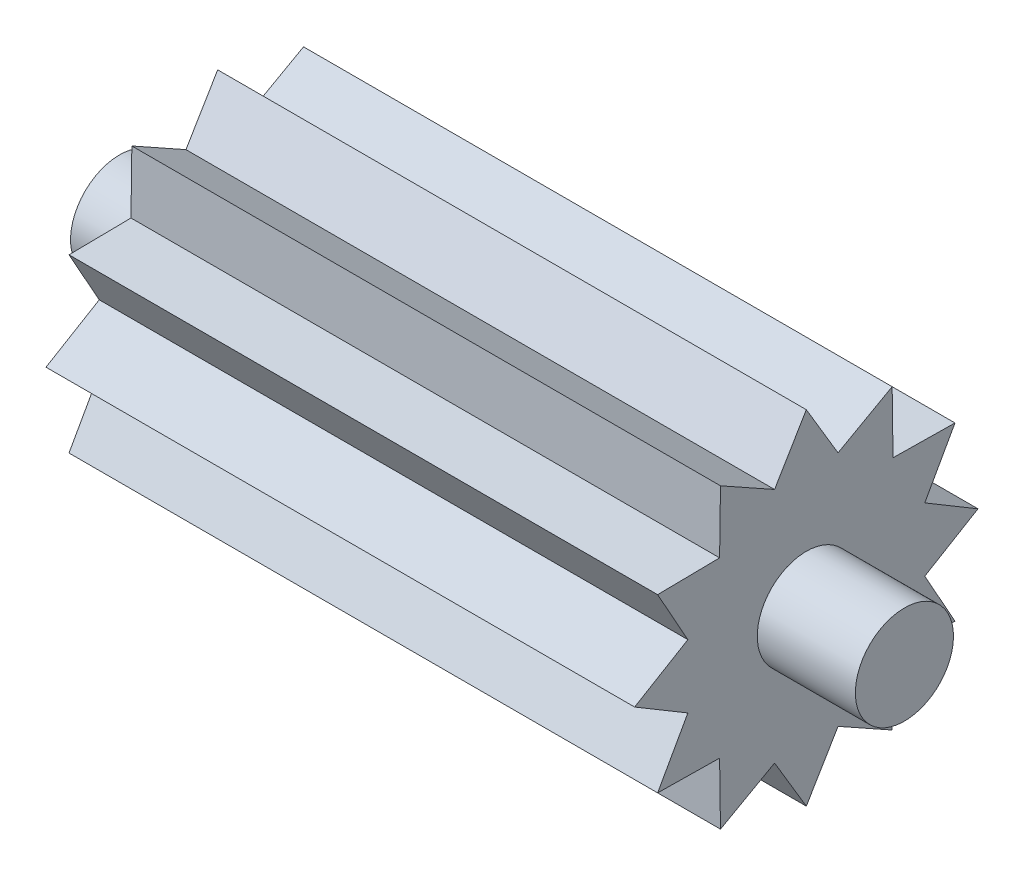
ISO-10303-21;
HEADER;
FILE_DESCRIPTION(('STEP AP214'),'2;1');
FILE_NAME('part.step','',(''),(''),'','','');
FILE_SCHEMA(('AUTOMOTIVE_DESIGN { 1 0 10303 214 1 1 1 1 }'));
ENDSEC;
DATA;
#1=APPLICATION_CONTEXT('core data for automotive mechanical design processes');
#2=APPLICATION_PROTOCOL_DEFINITION('international standard','automotive_design',2000,#1);
#3=PRODUCT_CONTEXT('',#1,'mechanical');
#4=PRODUCT('Part','Part','',(#3));
#5=PRODUCT_RELATED_PRODUCT_CATEGORY('part','',(#4));
#6=PRODUCT_DEFINITION_FORMATION('','',#4);
#7=PRODUCT_DEFINITION_CONTEXT('part definition',#1,'design');
#8=PRODUCT_DEFINITION('design','',#6,#7);
#9=PRODUCT_DEFINITION_SHAPE('','',#8);
#10=(LENGTH_UNIT() NAMED_UNIT(*) SI_UNIT(.MILLI.,.METRE.));
#11=(NAMED_UNIT(*) PLANE_ANGLE_UNIT() SI_UNIT($,.RADIAN.));
#12=(NAMED_UNIT(*) SI_UNIT($,.STERADIAN.) SOLID_ANGLE_UNIT());
#13=UNCERTAINTY_MEASURE_WITH_UNIT(LENGTH_MEASURE(1.E-05),#10,'distance_accuracy_value','');
#14=(GEOMETRIC_REPRESENTATION_CONTEXT(3) GLOBAL_UNCERTAINTY_ASSIGNED_CONTEXT((#13)) GLOBAL_UNIT_ASSIGNED_CONTEXT((#10,
#11,#12)) REPRESENTATION_CONTEXT('',''));
#15=CARTESIAN_POINT('',(0.,0.,0.));
#16=DIRECTION('',(0.,0.,1.));
#17=DIRECTION('',(1.,0.,0.));
#18=AXIS2_PLACEMENT_3D('',#15,#16,#17);
#19=CARTESIAN_POINT('',(15.,8.75,0.));
#20=DIRECTION('',(0.,-0.512128858498056,-0.858908628605789));
#21=DIRECTION('',(0.,0.85890862860579,-0.512128858498056));
#22=AXIS2_PLACEMENT_3D('',#19,#20,#21);
#23=PLANE('',#22);
#24=DIRECTION('',(-1.,0.,0.));
#25=VECTOR('',#24,1.);
#26=CARTESIAN_POINT('',(15.,8.75,0.));
#27=LINE('',#26,#25);
#28=CARTESIAN_POINT('',(15.,8.75,0.));
#29=VERTEX_POINT('',#28);
#30=CARTESIAN_POINT('',(-15.,8.75,0.));
#31=VERTEX_POINT('',#30);
#32=EDGE_CURVE('E201',#29,#31,#27,.T.);
#33=ORIENTED_EDGE('',*,*,#32,.T.);
#34=DIRECTION('',(0.,-0.858908628605789,0.512128858498056));
#35=VECTOR('',#34,1.);
#36=CARTESIAN_POINT('',(-15.,8.75,0.));
#37=LINE('',#36,#35);
#38=CARTESIAN_POINT('',(-15.,6.03703641430668,1.61761903189076));
#39=VERTEX_POINT('',#38);
#40=EDGE_CURVE('E204',#31,#39,#37,.T.);
#41=ORIENTED_EDGE('',*,*,#40,.T.);
#42=DIRECTION('',(-1.,0.,0.));
#43=VECTOR('',#42,1.);
#44=CARTESIAN_POINT('',(15.,6.03703641430668,1.61761903189076));
#45=LINE('',#44,#43);
#46=CARTESIAN_POINT('',(15.,6.03703641430668,1.61761903189076));
#47=VERTEX_POINT('',#46);
#48=EDGE_CURVE('E48',#47,#39,#45,.T.);
#49=ORIENTED_EDGE('',*,*,#48,.F.);
#50=DIRECTION('',(0.,-0.858908628605789,0.512128858498056));
#51=VECTOR('',#50,1.);
#52=CARTESIAN_POINT('',(15.,8.75,0.));
#53=LINE('',#52,#51);
#54=EDGE_CURVE('E206',#29,#47,#53,.T.);
#55=ORIENTED_EDGE('',*,*,#54,.F.);
#56=EDGE_LOOP('',(#33,#41,#49,#55));
#57=FACE_BOUND('',#56,.T.);
#58=ADVANCED_FACE('F41',(#57),#23,.F.);
#59=CARTESIAN_POINT('',(15.,7.57772228311389,4.3749999999999));
#60=DIRECTION('',(0.,-0.872970915773322,0.487772262653267));
#61=DIRECTION('',(0.,-0.487772262653267,-0.872970915773322));
#62=AXIS2_PLACEMENT_3D('',#59,#60,#61);
#63=PLANE('',#62);
#64=ORIENTED_EDGE('',*,*,#48,.T.);
#65=DIRECTION('',(0.,0.487772262653267,0.872970915773322));
#66=VECTOR('',#65,1.);
#67=CARTESIAN_POINT('',(-15.,7.57772228311389,4.3749999999999));
#68=LINE('',#67,#66);
#69=CARTESIAN_POINT('',(-15.,7.57772228311389,4.3749999999999));
#70=VERTEX_POINT('',#69);
#71=EDGE_CURVE('E219',#39,#70,#68,.T.);
#72=ORIENTED_EDGE('',*,*,#71,.T.);
#73=DIRECTION('',(-1.,0.,0.));
#74=VECTOR('',#73,1.);
#75=CARTESIAN_POINT('',(15.,7.57772228311389,4.3749999999999));
#76=LINE('',#75,#74);
#77=CARTESIAN_POINT('',(15.,7.57772228311389,4.3749999999999));
#78=VERTEX_POINT('',#77);
#79=EDGE_CURVE('E381',#78,#70,#76,.T.);
#80=ORIENTED_EDGE('',*,*,#79,.F.);
#81=DIRECTION('',(0.,0.487772262653267,0.872970915773322));
#82=VECTOR('',#81,1.);
#83=CARTESIAN_POINT('',(15.,7.57772228311389,4.3749999999999));
#84=LINE('',#83,#82);
#85=EDGE_CURVE('E296',#47,#78,#84,.T.);
#86=ORIENTED_EDGE('',*,*,#85,.F.);
#87=EDGE_LOOP('',(#64,#72,#80,#86));
#88=FACE_BOUND('',#87,.T.);
#89=ADVANCED_FACE('F383',(#88),#63,.F.);
#90=CARTESIAN_POINT('',(15.,7.57772228311389,4.3749999999999));
#91=DIRECTION('',(0.,-0.0140622871675821,-0.999901121151295));
#92=DIRECTION('',(0.,0.999901121151295,-0.0140622871675821));
#93=AXIS2_PLACEMENT_3D('',#90,#91,#92);
#94=PLANE('',#93);
#95=ORIENTED_EDGE('',*,*,#79,.T.);
#96=DIRECTION('',(0.,-0.999901121151295,0.0140622871675821));
#97=VECTOR('',#96,1.);
#98=CARTESIAN_POINT('',(-15.,7.57772228311389,4.3749999999999));
#99=LINE('',#98,#97);
#100=CARTESIAN_POINT('',(-15.,4.41941738241592,4.41941738241594));
#101=VERTEX_POINT('',#100);
#102=EDGE_CURVE('E285',#70,#101,#99,.T.);
#103=ORIENTED_EDGE('',*,*,#102,.T.);
#104=DIRECTION('',(-1.,0.,0.));
#105=VECTOR('',#104,1.);
#106=CARTESIAN_POINT('',(15.,4.41941738241592,4.41941738241594));
#107=LINE('',#106,#105);
#108=CARTESIAN_POINT('',(15.,4.41941738241592,4.41941738241594));
#109=VERTEX_POINT('',#108);
#110=EDGE_CURVE('E379',#109,#101,#107,.T.);
#111=ORIENTED_EDGE('',*,*,#110,.F.);
#112=DIRECTION('',(0.,-0.999901121151295,0.0140622871675821));
#113=VECTOR('',#112,1.);
#114=CARTESIAN_POINT('',(15.,7.57772228311389,4.3749999999999));
#115=LINE('',#114,#113);
#116=EDGE_CURVE('E298',#78,#109,#115,.T.);
#117=ORIENTED_EDGE('',*,*,#116,.F.);
#118=EDGE_LOOP('',(#95,#103,#111,#117));
#119=FACE_BOUND('',#118,.T.);
#120=ADVANCED_FACE('F405',(#119),#94,.F.);
#121=CARTESIAN_POINT('',(15.,4.37499999999999,7.57772228311385));
#122=DIRECTION('',(0.,-0.999901121151295,-0.0140622871675494));
#123=DIRECTION('',(0.,0.0140622871675494,-0.999901121151295));
#124=AXIS2_PLACEMENT_3D('',#121,#122,#123);
#125=PLANE('',#124);
#126=ORIENTED_EDGE('',*,*,#110,.T.);
#127=DIRECTION('',(0.,-0.0140622871675494,0.999901121151295));
#128=VECTOR('',#127,1.);
#129=CARTESIAN_POINT('',(-15.,4.37499999999999,7.57772228311385));
#130=LINE('',#129,#128);
#131=CARTESIAN_POINT('',(-15.,4.37499999999999,7.57772228311385));
#132=VERTEX_POINT('',#131);
#133=EDGE_CURVE('E282',#101,#132,#130,.T.);
#134=ORIENTED_EDGE('',*,*,#133,.T.);
#135=DIRECTION('',(-1.,0.,0.));
#136=VECTOR('',#135,1.);
#137=CARTESIAN_POINT('',(15.,4.37499999999999,7.57772228311385));
#138=LINE('',#137,#136);
#139=CARTESIAN_POINT('',(15.,4.37499999999999,7.57772228311385));
#140=VERTEX_POINT('',#139);
#141=EDGE_CURVE('E377',#140,#132,#138,.T.);
#142=ORIENTED_EDGE('',*,*,#141,.F.);
#143=DIRECTION('',(0.,-0.0140622871675494,0.999901121151295));
#144=VECTOR('',#143,1.);
#145=CARTESIAN_POINT('',(15.,4.37499999999999,7.57772228311385));
#146=LINE('',#145,#144);
#147=EDGE_CURVE('E300',#109,#140,#146,.T.);
#148=ORIENTED_EDGE('',*,*,#147,.F.);
#149=EDGE_LOOP('',(#126,#134,#142,#148));
#150=FACE_BOUND('',#149,.T.);
#151=ADVANCED_FACE('F409',(#150),#125,.F.);
#152=CARTESIAN_POINT('',(15.,4.37499999999999,7.57772228311385));
#153=DIRECTION('',(0.,0.48777226265324,-0.872970915773337));
#154=DIRECTION('',(0.,0.872970915773337,0.487772262653241));
#155=AXIS2_PLACEMENT_3D('',#152,#153,#154);
#156=PLANE('',#155);
#157=ORIENTED_EDGE('',*,*,#141,.T.);
#158=DIRECTION('',(0.,-0.872970915773337,-0.48777226265324));
#159=VECTOR('',#158,1.);
#160=CARTESIAN_POINT('',(-15.,4.37499999999999,7.57772228311385));
#161=LINE('',#160,#159);
#162=CARTESIAN_POINT('',(-15.,1.61761903189074,6.03703641430669));
#163=VERTEX_POINT('',#162);
#164=EDGE_CURVE('E279',#132,#163,#161,.T.);
#165=ORIENTED_EDGE('',*,*,#164,.T.);
#166=DIRECTION('',(-1.,0.,0.));
#167=VECTOR('',#166,1.);
#168=CARTESIAN_POINT('',(15.,1.61761903189074,6.03703641430669));
#169=LINE('',#168,#167);
#170=CARTESIAN_POINT('',(15.,1.61761903189074,6.03703641430669));
#171=VERTEX_POINT('',#170);
#172=EDGE_CURVE('E375',#171,#163,#169,.T.);
#173=ORIENTED_EDGE('',*,*,#172,.F.);
#174=DIRECTION('',(0.,-0.872970915773337,-0.48777226265324));
#175=VECTOR('',#174,1.);
#176=CARTESIAN_POINT('',(15.,4.37499999999999,7.57772228311385));
#177=LINE('',#176,#175);
#178=EDGE_CURVE('E302',#140,#171,#177,.T.);
#179=ORIENTED_EDGE('',*,*,#178,.F.);
#180=EDGE_LOOP('',(#157,#165,#173,#179));
#181=FACE_BOUND('',#180,.T.);
#182=ADVANCED_FACE('F415',(#181),#156,.F.);
#183=CARTESIAN_POINT('',(15.,0.,8.75000000000001));
#184=DIRECTION('',(0.,-0.858908628605789,-0.512128858498057));
#185=DIRECTION('',(0.,0.512128858498057,-0.858908628605789));
#186=AXIS2_PLACEMENT_3D('',#183,#184,#185);
#187=PLANE('',#186);
#188=ORIENTED_EDGE('',*,*,#172,.T.);
#189=DIRECTION('',(0.,-0.512128858498057,0.858908628605789));
#190=VECTOR('',#189,1.);
#191=CARTESIAN_POINT('',(-15.,0.,8.75000000000001));
#192=LINE('',#191,#190);
#193=CARTESIAN_POINT('',(-15.,0.,8.75000000000001));
#194=VERTEX_POINT('',#193);
#195=EDGE_CURVE('E276',#163,#194,#192,.T.);
#196=ORIENTED_EDGE('',*,*,#195,.T.);
#197=DIRECTION('',(-1.,0.,0.));
#198=VECTOR('',#197,1.);
#199=CARTESIAN_POINT('',(15.,0.,8.75000000000001));
#200=LINE('',#199,#198);
#201=CARTESIAN_POINT('',(15.,0.,8.75000000000001));
#202=VERTEX_POINT('',#201);
#203=EDGE_CURVE('E373',#202,#194,#200,.T.);
#204=ORIENTED_EDGE('',*,*,#203,.F.);
#205=DIRECTION('',(0.,-0.512128858498057,0.858908628605789));
#206=VECTOR('',#205,1.);
#207=CARTESIAN_POINT('',(15.,0.,8.75000000000001));
#208=LINE('',#207,#206);
#209=EDGE_CURVE('E304',#171,#202,#208,.T.);
#210=ORIENTED_EDGE('',*,*,#209,.F.);
#211=EDGE_LOOP('',(#188,#196,#204,#210));
#212=FACE_BOUND('',#211,.T.);
#213=ADVANCED_FACE('F419',(#212),#187,.F.);
#214=CARTESIAN_POINT('',(15.,0.,8.75000000000001));
#215=DIRECTION('',(0.,0.858908628605789,-0.512128858498057));
#216=DIRECTION('',(0.,0.512128858498057,0.858908628605789));
#217=AXIS2_PLACEMENT_3D('',#214,#215,#216);
#218=PLANE('',#217);
#219=ORIENTED_EDGE('',*,*,#203,.T.);
#220=DIRECTION('',(0.,-0.512128858498057,-0.858908628605789));
#221=VECTOR('',#220,1.);
#222=CARTESIAN_POINT('',(-15.,0.,8.75000000000001));
#223=LINE('',#222,#221);
#224=CARTESIAN_POINT('',(-15.,-1.61761903189077,6.03703641430669));
#225=VERTEX_POINT('',#224);
#226=EDGE_CURVE('E273',#194,#225,#223,.T.);
#227=ORIENTED_EDGE('',*,*,#226,.T.);
#228=DIRECTION('',(-1.,0.,0.));
#229=VECTOR('',#228,1.);
#230=CARTESIAN_POINT('',(15.,-1.61761903189077,6.03703641430669));
#231=LINE('',#230,#229);
#232=CARTESIAN_POINT('',(15.,-1.61761903189077,6.03703641430669));
#233=VERTEX_POINT('',#232);
#234=EDGE_CURVE('E371',#233,#225,#231,.T.);
#235=ORIENTED_EDGE('',*,*,#234,.F.);
#236=DIRECTION('',(0.,-0.512128858498057,-0.858908628605789));
#237=VECTOR('',#236,1.);
#238=CARTESIAN_POINT('',(15.,0.,8.75000000000001));
#239=LINE('',#238,#237);
#240=EDGE_CURVE('E306',#202,#233,#239,.T.);
#241=ORIENTED_EDGE('',*,*,#240,.F.);
#242=EDGE_LOOP('',(#219,#227,#235,#241));
#243=FACE_BOUND('',#242,.T.);
#244=ADVANCED_FACE('F423',(#243),#218,.F.);
#245=CARTESIAN_POINT('',(15.,-4.37500000000002,7.57772228311385));
#246=DIRECTION('',(0.,-0.487772262653239,-0.872970915773338));
#247=DIRECTION('',(0.,0.872970915773338,-0.487772262653239));
#248=AXIS2_PLACEMENT_3D('',#245,#246,#247);
#249=PLANE('',#248);
#250=ORIENTED_EDGE('',*,*,#234,.T.);
#251=DIRECTION('',(0.,-0.872970915773338,0.487772262653239));
#252=VECTOR('',#251,1.);
#253=CARTESIAN_POINT('',(-15.,-4.37500000000002,7.57772228311385));
#254=LINE('',#253,#252);
#255=CARTESIAN_POINT('',(-15.,-4.37500000000002,7.57772228311385));
#256=VERTEX_POINT('',#255);
#257=EDGE_CURVE('E270',#225,#256,#254,.T.);
#258=ORIENTED_EDGE('',*,*,#257,.T.);
#259=DIRECTION('',(-1.,0.,0.));
#260=VECTOR('',#259,1.);
#261=CARTESIAN_POINT('',(15.,-4.37500000000002,7.57772228311385));
#262=LINE('',#261,#260);
#263=CARTESIAN_POINT('',(15.,-4.37500000000002,7.57772228311385));
#264=VERTEX_POINT('',#263);
#265=EDGE_CURVE('E369',#264,#256,#262,.T.);
#266=ORIENTED_EDGE('',*,*,#265,.F.);
#267=DIRECTION('',(0.,-0.872970915773338,0.487772262653239));
#268=VECTOR('',#267,1.);
#269=CARTESIAN_POINT('',(15.,-4.37500000000002,7.57772228311385));
#270=LINE('',#269,#268);
#271=EDGE_CURVE('E308',#233,#264,#270,.T.);
#272=ORIENTED_EDGE('',*,*,#271,.F.);
#273=EDGE_LOOP('',(#250,#258,#266,#272));
#274=FACE_BOUND('',#273,.T.);
#275=ADVANCED_FACE('F427',(#274),#249,.F.);
#276=CARTESIAN_POINT('',(15.,-4.37500000000002,7.57772228311385));
#277=DIRECTION('',(0.,0.999901121151295,-0.0140622871675478));
#278=DIRECTION('',(0.,0.0140622871675478,0.999901121151295));
#279=AXIS2_PLACEMENT_3D('',#276,#277,#278);
#280=PLANE('',#279);
#281=ORIENTED_EDGE('',*,*,#265,.T.);
#282=DIRECTION('',(0.,-0.0140622871675478,-0.999901121151295));
#283=VECTOR('',#282,1.);
#284=CARTESIAN_POINT('',(-15.,-4.37500000000002,7.57772228311385));
#285=LINE('',#284,#283);
#286=CARTESIAN_POINT('',(-15.,-4.41941738241595,4.41941738241593));
#287=VERTEX_POINT('',#286);
#288=EDGE_CURVE('E267',#256,#287,#285,.T.);
#289=ORIENTED_EDGE('',*,*,#288,.T.);
#290=DIRECTION('',(-1.,0.,0.));
#291=VECTOR('',#290,1.);
#292=CARTESIAN_POINT('',(15.,-4.41941738241595,4.41941738241593));
#293=LINE('',#292,#291);
#294=CARTESIAN_POINT('',(15.,-4.41941738241595,4.41941738241593));
#295=VERTEX_POINT('',#294);
#296=EDGE_CURVE('E367',#295,#287,#293,.T.);
#297=ORIENTED_EDGE('',*,*,#296,.F.);
#298=DIRECTION('',(0.,-0.0140622871675478,-0.999901121151295));
#299=VECTOR('',#298,1.);
#300=CARTESIAN_POINT('',(15.,-4.37500000000002,7.57772228311385));
#301=LINE('',#300,#299);
#302=EDGE_CURVE('E310',#264,#295,#301,.T.);
#303=ORIENTED_EDGE('',*,*,#302,.F.);
#304=EDGE_LOOP('',(#281,#289,#297,#303));
#305=FACE_BOUND('',#304,.T.);
#306=ADVANCED_FACE('F431',(#305),#280,.F.);
#307=CARTESIAN_POINT('',(15.,-7.57772228311387,4.37500000000001));
#308=DIRECTION('',(0.,0.0140622871675489,-0.999901121151295));
#309=DIRECTION('',(0.,0.999901121151295,0.0140622871675489));
#310=AXIS2_PLACEMENT_3D('',#307,#308,#309);
#311=PLANE('',#310);
#312=ORIENTED_EDGE('',*,*,#296,.T.);
#313=DIRECTION('',(0.,-0.999901121151295,-0.0140622871675489));
#314=VECTOR('',#313,1.);
#315=CARTESIAN_POINT('',(-15.,-7.57772228311387,4.37500000000001));
#316=LINE('',#315,#314);
#317=CARTESIAN_POINT('',(-15.,-7.57772228311387,4.37500000000001));
#318=VERTEX_POINT('',#317);
#319=EDGE_CURVE('E264',#287,#318,#316,.T.);
#320=ORIENTED_EDGE('',*,*,#319,.T.);
#321=DIRECTION('',(-1.,0.,0.));
#322=VECTOR('',#321,1.);
#323=CARTESIAN_POINT('',(15.,-7.57772228311387,4.37500000000001));
#324=LINE('',#323,#322);
#325=CARTESIAN_POINT('',(15.,-7.57772228311387,4.37500000000001));
#326=VERTEX_POINT('',#325);
#327=EDGE_CURVE('E365',#326,#318,#324,.T.);
#328=ORIENTED_EDGE('',*,*,#327,.F.);
#329=DIRECTION('',(0.,-0.999901121151295,-0.0140622871675489));
#330=VECTOR('',#329,1.);
#331=CARTESIAN_POINT('',(15.,-7.57772228311387,4.37500000000001));
#332=LINE('',#331,#330);
#333=EDGE_CURVE('E312',#295,#326,#332,.T.);
#334=ORIENTED_EDGE('',*,*,#333,.F.);
#335=EDGE_LOOP('',(#312,#320,#328,#334));
#336=FACE_BOUND('',#335,.T.);
#337=ADVANCED_FACE('F435',(#336),#311,.F.);
#338=CARTESIAN_POINT('',(15.,-7.57772228311387,4.37500000000001));
#339=DIRECTION('',(0.,0.872970915773337,0.48777226265324));
#340=DIRECTION('',(0.,-0.48777226265324,0.872970915773337));
#341=AXIS2_PLACEMENT_3D('',#338,#339,#340);
#342=PLANE('',#341);
#343=ORIENTED_EDGE('',*,*,#327,.T.);
#344=DIRECTION('',(0.,0.48777226265324,-0.872970915773337));
#345=VECTOR('',#344,1.);
#346=CARTESIAN_POINT('',(-15.,-7.57772228311387,4.37500000000001));
#347=LINE('',#346,#345);
#348=CARTESIAN_POINT('',(-15.,-6.0370364143067,1.61761903189076));
#349=VERTEX_POINT('',#348);
#350=EDGE_CURVE('E261',#318,#349,#347,.T.);
#351=ORIENTED_EDGE('',*,*,#350,.T.);
#352=DIRECTION('',(-1.,0.,0.));
#353=VECTOR('',#352,1.);
#354=CARTESIAN_POINT('',(15.,-6.0370364143067,1.61761903189076));
#355=LINE('',#354,#353);
#356=CARTESIAN_POINT('',(15.,-6.0370364143067,1.61761903189076));
#357=VERTEX_POINT('',#356);
#358=EDGE_CURVE('E363',#357,#349,#355,.T.);
#359=ORIENTED_EDGE('',*,*,#358,.F.);
#360=DIRECTION('',(0.,0.48777226265324,-0.872970915773337));
#361=VECTOR('',#360,1.);
#362=CARTESIAN_POINT('',(15.,-7.57772228311387,4.37500000000001));
#363=LINE('',#362,#361);
#364=EDGE_CURVE('E314',#326,#357,#363,.T.);
#365=ORIENTED_EDGE('',*,*,#364,.F.);
#366=EDGE_LOOP('',(#343,#351,#359,#365));
#367=FACE_BOUND('',#366,.T.);
#368=ADVANCED_FACE('F439',(#367),#342,.F.);
#369=CARTESIAN_POINT('',(15.,-8.75000000000003,0.));
#370=DIRECTION('',(0.,0.512128858498056,-0.858908628605789));
#371=DIRECTION('',(0.,0.858908628605789,0.512128858498057));
#372=AXIS2_PLACEMENT_3D('',#369,#370,#371);
#373=PLANE('',#372);
#374=ORIENTED_EDGE('',*,*,#358,.T.);
#375=DIRECTION('',(0.,-0.858908628605789,-0.512128858498056));
#376=VECTOR('',#375,1.);
#377=CARTESIAN_POINT('',(-15.,-8.75000000000003,0.));
#378=LINE('',#377,#376);
#379=CARTESIAN_POINT('',(-15.,-8.75000000000003,0.));
#380=VERTEX_POINT('',#379);
#381=EDGE_CURVE('E258',#349,#380,#378,.T.);
#382=ORIENTED_EDGE('',*,*,#381,.T.);
#383=DIRECTION('',(-1.,0.,0.));
#384=VECTOR('',#383,1.);
#385=CARTESIAN_POINT('',(15.,-8.75000000000003,0.));
#386=LINE('',#385,#384);
#387=CARTESIAN_POINT('',(15.,-8.75000000000003,0.));
#388=VERTEX_POINT('',#387);
#389=EDGE_CURVE('E361',#388,#380,#386,.T.);
#390=ORIENTED_EDGE('',*,*,#389,.F.);
#391=DIRECTION('',(0.,-0.858908628605789,-0.512128858498056));
#392=VECTOR('',#391,1.);
#393=CARTESIAN_POINT('',(15.,-8.75000000000003,0.));
#394=LINE('',#393,#392);
#395=EDGE_CURVE('E316',#357,#388,#394,.T.);
#396=ORIENTED_EDGE('',*,*,#395,.F.);
#397=EDGE_LOOP('',(#374,#382,#390,#396));
#398=FACE_BOUND('',#397,.T.);
#399=ADVANCED_FACE('F443',(#398),#373,.F.);
#400=CARTESIAN_POINT('',(15.,-8.75000000000003,0.));
#401=DIRECTION('',(0.,0.512128858498057,0.858908628605789));
#402=DIRECTION('',(0.,-0.858908628605789,0.512128858498057));
#403=AXIS2_PLACEMENT_3D('',#400,#401,#402);
#404=PLANE('',#403);
#405=ORIENTED_EDGE('',*,*,#389,.T.);
#406=DIRECTION('',(0.,0.858908628605789,-0.512128858498057));
#407=VECTOR('',#406,1.);
#408=CARTESIAN_POINT('',(-15.,-8.75000000000003,0.));
#409=LINE('',#408,#407);
#410=CARTESIAN_POINT('',(-15.,-6.0370364143067,-1.61761903189076));
#411=VERTEX_POINT('',#410);
#412=EDGE_CURVE('E255',#380,#411,#409,.T.);
#413=ORIENTED_EDGE('',*,*,#412,.T.);
#414=DIRECTION('',(-1.,0.,0.));
#415=VECTOR('',#414,1.);
#416=CARTESIAN_POINT('',(15.,-6.0370364143067,-1.61761903189076));
#417=LINE('',#416,#415);
#418=CARTESIAN_POINT('',(15.,-6.0370364143067,-1.61761903189076));
#419=VERTEX_POINT('',#418);
#420=EDGE_CURVE('E359',#419,#411,#417,.T.);
#421=ORIENTED_EDGE('',*,*,#420,.F.);
#422=DIRECTION('',(0.,0.858908628605789,-0.512128858498057));
#423=VECTOR('',#422,1.);
#424=CARTESIAN_POINT('',(15.,-8.75000000000003,0.));
#425=LINE('',#424,#423);
#426=EDGE_CURVE('E318',#388,#419,#425,.T.);
#427=ORIENTED_EDGE('',*,*,#426,.F.);
#428=EDGE_LOOP('',(#405,#413,#421,#427));
#429=FACE_BOUND('',#428,.T.);
#430=ADVANCED_FACE('F447',(#429),#404,.F.);
#431=CARTESIAN_POINT('',(15.,-7.57772228311386,-4.37500000000001));
#432=DIRECTION('',(0.,0.872970915773338,-0.487772262653239));
#433=DIRECTION('',(0.,0.487772262653239,0.872970915773338));
#434=AXIS2_PLACEMENT_3D('',#431,#432,#433);
#435=PLANE('',#434);
#436=ORIENTED_EDGE('',*,*,#420,.T.);
#437=DIRECTION('',(0.,-0.487772262653239,-0.872970915773338));
#438=VECTOR('',#437,1.);
#439=CARTESIAN_POINT('',(-15.,-7.57772228311386,-4.37500000000001));
#440=LINE('',#439,#438);
#441=CARTESIAN_POINT('',(-15.,-7.57772228311386,-4.37500000000001));
#442=VERTEX_POINT('',#441);
#443=EDGE_CURVE('E252',#411,#442,#440,.T.);
#444=ORIENTED_EDGE('',*,*,#443,.T.);
#445=DIRECTION('',(-1.,0.,0.));
#446=VECTOR('',#445,1.);
#447=CARTESIAN_POINT('',(15.,-7.57772228311386,-4.37500000000001));
#448=LINE('',#447,#446);
#449=CARTESIAN_POINT('',(15.,-7.57772228311386,-4.37500000000001));
#450=VERTEX_POINT('',#449);
#451=EDGE_CURVE('E357',#450,#442,#448,.T.);
#452=ORIENTED_EDGE('',*,*,#451,.F.);
#453=DIRECTION('',(0.,-0.487772262653239,-0.872970915773338));
#454=VECTOR('',#453,1.);
#455=CARTESIAN_POINT('',(15.,-7.57772228311386,-4.37500000000001));
#456=LINE('',#455,#454);
#457=EDGE_CURVE('E320',#419,#450,#456,.T.);
#458=ORIENTED_EDGE('',*,*,#457,.F.);
#459=EDGE_LOOP('',(#436,#444,#452,#458));
#460=FACE_BOUND('',#459,.T.);
#461=ADVANCED_FACE('F451',(#460),#435,.F.);
#462=CARTESIAN_POINT('',(15.,-7.57772228311386,-4.37500000000001));
#463=DIRECTION('',(0.,0.0140622871675478,0.999901121151295));
#464=DIRECTION('',(0.,-0.999901121151295,0.0140622871675478));
#465=AXIS2_PLACEMENT_3D('',#462,#463,#464);
#466=PLANE('',#465);
#467=ORIENTED_EDGE('',*,*,#451,.T.);
#468=DIRECTION('',(0.,0.999901121151295,-0.0140622871675478));
#469=VECTOR('',#468,1.);
#470=CARTESIAN_POINT('',(-15.,-7.57772228311386,-4.37500000000001));
#471=LINE('',#470,#469);
#472=CARTESIAN_POINT('',(-15.,-4.41941738241595,-4.41941738241593));
#473=VERTEX_POINT('',#472);
#474=EDGE_CURVE('E249',#442,#473,#471,.T.);
#475=ORIENTED_EDGE('',*,*,#474,.T.);
#476=DIRECTION('',(-1.,0.,0.));
#477=VECTOR('',#476,1.);
#478=CARTESIAN_POINT('',(15.,-4.41941738241595,-4.41941738241593));
#479=LINE('',#478,#477);
#480=CARTESIAN_POINT('',(15.,-4.41941738241595,-4.41941738241593));
#481=VERTEX_POINT('',#480);
#482=EDGE_CURVE('E355',#481,#473,#479,.T.);
#483=ORIENTED_EDGE('',*,*,#482,.F.);
#484=DIRECTION('',(0.,0.999901121151295,-0.0140622871675478));
#485=VECTOR('',#484,1.);
#486=CARTESIAN_POINT('',(15.,-7.57772228311386,-4.37500000000001));
#487=LINE('',#486,#485);
#488=EDGE_CURVE('E322',#450,#481,#487,.T.);
#489=ORIENTED_EDGE('',*,*,#488,.F.);
#490=EDGE_LOOP('',(#467,#475,#483,#489));
#491=FACE_BOUND('',#490,.T.);
#492=ADVANCED_FACE('F455',(#491),#466,.F.);
#493=CARTESIAN_POINT('',(15.,-4.37500000000002,-7.57772228311385));
#494=DIRECTION('',(0.,0.999901121151295,0.0140622871675486));
#495=DIRECTION('',(0.,-0.0140622871675486,0.999901121151295));
#496=AXIS2_PLACEMENT_3D('',#493,#494,#495);
#497=PLANE('',#496);
#498=ORIENTED_EDGE('',*,*,#482,.T.);
#499=DIRECTION('',(0.,0.0140622871675486,-0.999901121151295));
#500=VECTOR('',#499,1.);
#501=CARTESIAN_POINT('',(-15.,-4.37500000000002,-7.57772228311385));
#502=LINE('',#501,#500);
#503=CARTESIAN_POINT('',(-15.,-4.37500000000002,-7.57772228311385));
#504=VERTEX_POINT('',#503);
#505=EDGE_CURVE('E246',#473,#504,#502,.T.);
#506=ORIENTED_EDGE('',*,*,#505,.T.);
#507=DIRECTION('',(-1.,0.,0.));
#508=VECTOR('',#507,1.);
#509=CARTESIAN_POINT('',(15.,-4.37500000000002,-7.57772228311385));
#510=LINE('',#509,#508);
#511=CARTESIAN_POINT('',(15.,-4.37500000000002,-7.57772228311385));
#512=VERTEX_POINT('',#511);
#513=EDGE_CURVE('E353',#512,#504,#510,.T.);
#514=ORIENTED_EDGE('',*,*,#513,.F.);
#515=DIRECTION('',(0.,0.0140622871675486,-0.999901121151295));
#516=VECTOR('',#515,1.);
#517=CARTESIAN_POINT('',(15.,-4.37500000000002,-7.57772228311385));
#518=LINE('',#517,#516);
#519=EDGE_CURVE('E324',#481,#512,#518,.T.);
#520=ORIENTED_EDGE('',*,*,#519,.F.);
#521=EDGE_LOOP('',(#498,#506,#514,#520));
#522=FACE_BOUND('',#521,.T.);
#523=ADVANCED_FACE('F459',(#522),#497,.F.);
#524=CARTESIAN_POINT('',(15.,-4.37500000000002,-7.57772228311385));
#525=DIRECTION('',(0.,-0.48777226265324,0.872970915773337));
#526=DIRECTION('',(0.,-0.872970915773337,-0.48777226265324));
#527=AXIS2_PLACEMENT_3D('',#524,#525,#526);
#528=PLANE('',#527);
#529=ORIENTED_EDGE('',*,*,#513,.T.);
#530=DIRECTION('',(0.,0.872970915773337,0.48777226265324));
#531=VECTOR('',#530,1.);
#532=CARTESIAN_POINT('',(-15.,-4.37500000000002,-7.57772228311385));
#533=LINE('',#532,#531);
#534=CARTESIAN_POINT('',(-15.,-1.61761903189077,-6.03703641430669));
#535=VERTEX_POINT('',#534);
#536=EDGE_CURVE('E243',#504,#535,#533,.T.);
#537=ORIENTED_EDGE('',*,*,#536,.T.);
#538=DIRECTION('',(-1.,0.,0.));
#539=VECTOR('',#538,1.);
#540=CARTESIAN_POINT('',(15.,-1.61761903189077,-6.03703641430669));
#541=LINE('',#540,#539);
#542=CARTESIAN_POINT('',(15.,-1.61761903189077,-6.03703641430669));
#543=VERTEX_POINT('',#542);
#544=EDGE_CURVE('E351',#543,#535,#541,.T.);
#545=ORIENTED_EDGE('',*,*,#544,.F.);
#546=DIRECTION('',(0.,0.872970915773337,0.48777226265324));
#547=VECTOR('',#546,1.);
#548=CARTESIAN_POINT('',(15.,-4.37500000000002,-7.57772228311385));
#549=LINE('',#548,#547);
#550=EDGE_CURVE('E326',#512,#543,#549,.T.);
#551=ORIENTED_EDGE('',*,*,#550,.F.);
#552=EDGE_LOOP('',(#529,#537,#545,#551));
#553=FACE_BOUND('',#552,.T.);
#554=ADVANCED_FACE('F463',(#553),#528,.F.);
#555=CARTESIAN_POINT('',(15.,0.,-8.75000000000001));
#556=DIRECTION('',(0.,0.858908628605789,0.512128858498056));
#557=DIRECTION('',(0.,-0.512128858498057,0.858908628605789));
#558=AXIS2_PLACEMENT_3D('',#555,#556,#557);
#559=PLANE('',#558);
#560=ORIENTED_EDGE('',*,*,#544,.T.);
#561=DIRECTION('',(0.,0.512128858498056,-0.858908628605789));
#562=VECTOR('',#561,1.);
#563=CARTESIAN_POINT('',(-15.,0.,-8.75000000000001));
#564=LINE('',#563,#562);
#565=CARTESIAN_POINT('',(-15.,0.,-8.75000000000001));
#566=VERTEX_POINT('',#565);
#567=EDGE_CURVE('E240',#535,#566,#564,.T.);
#568=ORIENTED_EDGE('',*,*,#567,.T.);
#569=DIRECTION('',(-1.,0.,0.));
#570=VECTOR('',#569,1.);
#571=CARTESIAN_POINT('',(15.,0.,-8.75000000000001));
#572=LINE('',#571,#570);
#573=CARTESIAN_POINT('',(15.,0.,-8.75000000000001));
#574=VERTEX_POINT('',#573);
#575=EDGE_CURVE('E349',#574,#566,#572,.T.);
#576=ORIENTED_EDGE('',*,*,#575,.F.);
#577=DIRECTION('',(0.,0.512128858498056,-0.858908628605789));
#578=VECTOR('',#577,1.);
#579=CARTESIAN_POINT('',(15.,0.,-8.75000000000001));
#580=LINE('',#579,#578);
#581=EDGE_CURVE('E328',#543,#574,#580,.T.);
#582=ORIENTED_EDGE('',*,*,#581,.F.);
#583=EDGE_LOOP('',(#560,#568,#576,#582));
#584=FACE_BOUND('',#583,.T.);
#585=ADVANCED_FACE('F467',(#584),#559,.F.);
#586=CARTESIAN_POINT('',(15.,0.,-8.75000000000001));
#587=DIRECTION('',(0.,-0.858908628605789,0.512128858498056));
#588=DIRECTION('',(0.,-0.512128858498056,-0.858908628605789));
#589=AXIS2_PLACEMENT_3D('',#586,#587,#588);
#590=PLANE('',#589);
#591=ORIENTED_EDGE('',*,*,#575,.T.);
#592=DIRECTION('',(0.,0.512128858498056,0.858908628605789));
#593=VECTOR('',#592,1.);
#594=CARTESIAN_POINT('',(-15.,0.,-8.75000000000001));
#595=LINE('',#594,#593);
#596=CARTESIAN_POINT('',(-15.,1.61761903189074,-6.03703641430669));
#597=VERTEX_POINT('',#596);
#598=EDGE_CURVE('E237',#566,#597,#595,.T.);
#599=ORIENTED_EDGE('',*,*,#598,.T.);
#600=DIRECTION('',(-1.,0.,0.));
#601=VECTOR('',#600,1.);
#602=CARTESIAN_POINT('',(15.,1.61761903189074,-6.03703641430669));
#603=LINE('',#602,#601);
#604=CARTESIAN_POINT('',(15.,1.61761903189074,-6.03703641430669));
#605=VERTEX_POINT('',#604);
#606=EDGE_CURVE('E347',#605,#597,#603,.T.);
#607=ORIENTED_EDGE('',*,*,#606,.F.);
#608=DIRECTION('',(0.,0.512128858498056,0.858908628605789));
#609=VECTOR('',#608,1.);
#610=CARTESIAN_POINT('',(15.,0.,-8.75000000000001));
#611=LINE('',#610,#609);
#612=EDGE_CURVE('E330',#574,#605,#611,.T.);
#613=ORIENTED_EDGE('',*,*,#612,.F.);
#614=EDGE_LOOP('',(#591,#599,#607,#613));
#615=FACE_BOUND('',#614,.T.);
#616=ADVANCED_FACE('F471',(#615),#590,.F.);
#617=CARTESIAN_POINT('',(15.,4.37499999999999,-7.57772228311385));
#618=DIRECTION('',(0.,0.487772262653239,0.872970915773338));
#619=DIRECTION('',(0.,-0.872970915773338,0.487772262653239));
#620=AXIS2_PLACEMENT_3D('',#617,#618,#619);
#621=PLANE('',#620);
#622=ORIENTED_EDGE('',*,*,#606,.T.);
#623=DIRECTION('',(0.,0.872970915773338,-0.487772262653239));
#624=VECTOR('',#623,1.);
#625=CARTESIAN_POINT('',(-15.,4.37499999999999,-7.57772228311385));
#626=LINE('',#625,#624);
#627=CARTESIAN_POINT('',(-15.,4.37499999999999,-7.57772228311385));
#628=VERTEX_POINT('',#627);
#629=EDGE_CURVE('E234',#597,#628,#626,.T.);
#630=ORIENTED_EDGE('',*,*,#629,.T.);
#631=DIRECTION('',(-1.,0.,0.));
#632=VECTOR('',#631,1.);
#633=CARTESIAN_POINT('',(15.,4.37499999999999,-7.57772228311385));
#634=LINE('',#633,#632);
#635=CARTESIAN_POINT('',(15.,4.37499999999999,-7.57772228311385));
#636=VERTEX_POINT('',#635);
#637=EDGE_CURVE('E345',#636,#628,#634,.T.);
#638=ORIENTED_EDGE('',*,*,#637,.F.);
#639=DIRECTION('',(0.,0.872970915773338,-0.487772262653239));
#640=VECTOR('',#639,1.);
#641=CARTESIAN_POINT('',(15.,4.37499999999999,-7.57772228311385));
#642=LINE('',#641,#640);
#643=EDGE_CURVE('E332',#605,#636,#642,.T.);
#644=ORIENTED_EDGE('',*,*,#643,.F.);
#645=EDGE_LOOP('',(#622,#630,#638,#644));
#646=FACE_BOUND('',#645,.T.);
#647=ADVANCED_FACE('F475',(#646),#621,.F.);
#648=CARTESIAN_POINT('',(15.,4.37499999999999,-7.57772228311385));
#649=DIRECTION('',(0.,-0.999901121151295,0.0140622871675472));
#650=DIRECTION('',(0.,-0.0140622871675472,-0.999901121151295));
#651=AXIS2_PLACEMENT_3D('',#648,#649,#650);
#652=PLANE('',#651);
#653=ORIENTED_EDGE('',*,*,#637,.T.);
#654=DIRECTION('',(0.,0.0140622871675472,0.999901121151295));
#655=VECTOR('',#654,1.);
#656=CARTESIAN_POINT('',(-15.,4.37499999999999,-7.57772228311385));
#657=LINE('',#656,#655);
#658=CARTESIAN_POINT('',(-15.,4.41941738241592,-4.41941738241593));
#659=VERTEX_POINT('',#658);
#660=EDGE_CURVE('E231',#628,#659,#657,.T.);
#661=ORIENTED_EDGE('',*,*,#660,.T.);
#662=DIRECTION('',(-1.,0.,0.));
#663=VECTOR('',#662,1.);
#664=CARTESIAN_POINT('',(15.,4.41941738241592,-4.41941738241593));
#665=LINE('',#664,#663);
#666=CARTESIAN_POINT('',(15.,4.41941738241592,-4.41941738241593));
#667=VERTEX_POINT('',#666);
#668=EDGE_CURVE('E343',#667,#659,#665,.T.);
#669=ORIENTED_EDGE('',*,*,#668,.F.);
#670=DIRECTION('',(0.,0.0140622871675472,0.999901121151295));
#671=VECTOR('',#670,1.);
#672=CARTESIAN_POINT('',(15.,4.37499999999999,-7.57772228311385));
#673=LINE('',#672,#671);
#674=EDGE_CURVE('E334',#636,#667,#673,.T.);
#675=ORIENTED_EDGE('',*,*,#674,.F.);
#676=EDGE_LOOP('',(#653,#661,#669,#675));
#677=FACE_BOUND('',#676,.T.);
#678=ADVANCED_FACE('F479',(#677),#652,.F.);
#679=CARTESIAN_POINT('',(15.,7.57772228311383,-4.37500000000001));
#680=DIRECTION('',(0.,-0.0140622871675469,0.999901121151295));
#681=DIRECTION('',(0.,-0.999901121151295,-0.0140622871675469));
#682=AXIS2_PLACEMENT_3D('',#679,#680,#681);
#683=PLANE('',#682);
#684=ORIENTED_EDGE('',*,*,#668,.T.);
#685=DIRECTION('',(0.,0.999901121151295,0.0140622871675469));
#686=VECTOR('',#685,1.);
#687=CARTESIAN_POINT('',(-15.,7.57772228311383,-4.37500000000001));
#688=LINE('',#687,#686);
#689=CARTESIAN_POINT('',(-15.,7.57772228311383,-4.37500000000001));
#690=VERTEX_POINT('',#689);
#691=EDGE_CURVE('E225',#659,#690,#688,.T.);
#692=ORIENTED_EDGE('',*,*,#691,.T.);
#693=DIRECTION('',(-1.,0.,0.));
#694=VECTOR('',#693,1.);
#695=CARTESIAN_POINT('',(15.,7.57772228311383,-4.37500000000001));
#696=LINE('',#695,#694);
#697=CARTESIAN_POINT('',(15.,7.57772228311383,-4.37500000000001));
#698=VERTEX_POINT('',#697);
#699=EDGE_CURVE('E341',#698,#690,#696,.T.);
#700=ORIENTED_EDGE('',*,*,#699,.F.);
#701=DIRECTION('',(0.,0.999901121151295,0.0140622871675469));
#702=VECTOR('',#701,1.);
#703=CARTESIAN_POINT('',(15.,7.57772228311383,-4.37500000000001));
#704=LINE('',#703,#702);
#705=EDGE_CURVE('E336',#667,#698,#704,.T.);
#706=ORIENTED_EDGE('',*,*,#705,.F.);
#707=EDGE_LOOP('',(#684,#692,#700,#706));
#708=FACE_BOUND('',#707,.T.);
#709=ADVANCED_FACE('F483',(#708),#683,.F.);
#710=CARTESIAN_POINT('',(15.,7.57772228311383,-4.37500000000001));
#711=DIRECTION('',(0.,-0.872970915773338,-0.487772262653238));
#712=DIRECTION('',(0.,0.487772262653238,-0.872970915773338));
#713=AXIS2_PLACEMENT_3D('',#710,#711,#712);
#714=PLANE('',#713);
#715=ORIENTED_EDGE('',*,*,#699,.T.);
#716=DIRECTION('',(0.,-0.487772262653238,0.872970915773338));
#717=VECTOR('',#716,1.);
#718=CARTESIAN_POINT('',(-15.,7.57772228311383,-4.37500000000001));
#719=LINE('',#718,#717);
#720=CARTESIAN_POINT('',(-15.,6.03703641430668,-1.61761903189076));
#721=VERTEX_POINT('',#720);
#722=EDGE_CURVE('E223',#690,#721,#719,.T.);
#723=ORIENTED_EDGE('',*,*,#722,.T.);
#724=DIRECTION('',(-1.,0.,0.));
#725=VECTOR('',#724,1.);
#726=CARTESIAN_POINT('',(15.,6.03703641430668,-1.61761903189076));
#727=LINE('',#726,#725);
#728=CARTESIAN_POINT('',(15.,6.03703641430668,-1.61761903189076));
#729=VERTEX_POINT('',#728);
#730=EDGE_CURVE('E209',#729,#721,#727,.T.);
#731=ORIENTED_EDGE('',*,*,#730,.F.);
#732=DIRECTION('',(0.,-0.487772262653238,0.872970915773338));
#733=VECTOR('',#732,1.);
#734=CARTESIAN_POINT('',(15.,7.57772228311383,-4.37500000000001));
#735=LINE('',#734,#733);
#736=EDGE_CURVE('E60',#698,#729,#735,.T.);
#737=ORIENTED_EDGE('',*,*,#736,.F.);
#738=EDGE_LOOP('',(#715,#723,#731,#737));
#739=FACE_BOUND('',#738,.T.);
#740=ADVANCED_FACE('F398',(#739),#714,.F.);
#741=CARTESIAN_POINT('',(15.,8.75,0.));
#742=DIRECTION('',(0.,-0.512128858498056,0.858908628605789));
#743=DIRECTION('',(0.,-0.85890862860579,-0.512128858498056));
#744=AXIS2_PLACEMENT_3D('',#741,#742,#743);
#745=PLANE('',#744);
#746=ORIENTED_EDGE('',*,*,#730,.T.);
#747=DIRECTION('',(0.,0.858908628605789,0.512128858498056));
#748=VECTOR('',#747,1.);
#749=CARTESIAN_POINT('',(-15.,8.75,0.));
#750=LINE('',#749,#748);
#751=EDGE_CURVE('E215',#721,#31,#750,.T.);
#752=ORIENTED_EDGE('',*,*,#751,.T.);
#753=ORIENTED_EDGE('',*,*,#32,.F.);
#754=DIRECTION('',(0.,0.858908628605789,0.512128858498056));
#755=VECTOR('',#754,1.);
#756=CARTESIAN_POINT('',(15.,8.75,0.));
#757=LINE('',#756,#755);
#758=EDGE_CURVE('E55',#729,#29,#757,.T.);
#759=ORIENTED_EDGE('',*,*,#758,.F.);
#760=EDGE_LOOP('',(#746,#752,#753,#759));
#761=FACE_BOUND('',#760,.T.);
#762=ADVANCED_FACE('F222',(#761),#745,.F.);
#763=CARTESIAN_POINT('',(15.,0.,0.));
#764=DIRECTION('',(1.,0.,0.));
#765=DIRECTION('',(0.,0.,-1.));
#766=AXIS2_PLACEMENT_3D('',#763,#764,#765);
#767=PLANE('',#766);
#768=CARTESIAN_POINT('',(15.,0.,0.));
#769=DIRECTION('',(1.,0.,0.));
#770=DIRECTION('',(0.,0.,-1.));
#771=AXIS2_PLACEMENT_3D('',#768,#769,#770);
#772=CIRCLE('',#771,2.5);
#773=CARTESIAN_POINT('',(15.,0.,-2.5));
#774=VERTEX_POINT('',#773);
#775=EDGE_CURVE('E289',#774,#774,#772,.T.);
#776=ORIENTED_EDGE('',*,*,#775,.F.);
#777=EDGE_LOOP('',(#776));
#778=FACE_BOUND('',#777,.T.);
#779=ORIENTED_EDGE('',*,*,#54,.T.);
#780=ORIENTED_EDGE('',*,*,#85,.T.);
#781=ORIENTED_EDGE('',*,*,#116,.T.);
#782=ORIENTED_EDGE('',*,*,#147,.T.);
#783=ORIENTED_EDGE('',*,*,#178,.T.);
#784=ORIENTED_EDGE('',*,*,#209,.T.);
#785=ORIENTED_EDGE('',*,*,#240,.T.);
#786=ORIENTED_EDGE('',*,*,#271,.T.);
#787=ORIENTED_EDGE('',*,*,#302,.T.);
#788=ORIENTED_EDGE('',*,*,#333,.T.);
#789=ORIENTED_EDGE('',*,*,#364,.T.);
#790=ORIENTED_EDGE('',*,*,#395,.T.);
#791=ORIENTED_EDGE('',*,*,#426,.T.);
#792=ORIENTED_EDGE('',*,*,#457,.T.);
#793=ORIENTED_EDGE('',*,*,#488,.T.);
#794=ORIENTED_EDGE('',*,*,#519,.T.);
#795=ORIENTED_EDGE('',*,*,#550,.T.);
#796=ORIENTED_EDGE('',*,*,#581,.T.);
#797=ORIENTED_EDGE('',*,*,#612,.T.);
#798=ORIENTED_EDGE('',*,*,#643,.T.);
#799=ORIENTED_EDGE('',*,*,#674,.T.);
#800=ORIENTED_EDGE('',*,*,#705,.T.);
#801=ORIENTED_EDGE('',*,*,#736,.T.);
#802=ORIENTED_EDGE('',*,*,#758,.T.);
#803=EDGE_LOOP('',(#779,#780,#781,#782,#783,#784,#785,#786,#787,#788,#789,#790,#791,#792,#793,
#794,#795,#796,#797,#798,#799,#800,#801,#802));
#804=FACE_BOUND('',#803,.T.);
#805=ADVANCED_FACE('F386',(#778,#804),#767,.T.);
#806=CARTESIAN_POINT('',(20.,0.,0.));
#807=DIRECTION('',(-1.,0.,0.));
#808=DIRECTION('',(0.,0.,1.));
#809=AXIS2_PLACEMENT_3D('',#806,#807,#808);
#810=CYLINDRICAL_SURFACE('',#809,2.5);
#811=CARTESIAN_POINT('',(20.,0.,0.));
#812=DIRECTION('',(1.,0.,0.));
#813=DIRECTION('',(0.,0.,-1.));
#814=AXIS2_PLACEMENT_3D('',#811,#812,#813);
#815=CIRCLE('',#814,2.5);
#816=CARTESIAN_POINT('',(20.,0.,-2.5));
#817=VERTEX_POINT('',#816);
#818=EDGE_CURVE('E290',#817,#817,#815,.T.);
#819=ORIENTED_EDGE('',*,*,#818,.F.);
#820=EDGE_LOOP('',(#819));
#821=FACE_BOUND('',#820,.T.);
#822=ORIENTED_EDGE('',*,*,#775,.T.);
#823=EDGE_LOOP('',(#822));
#824=FACE_BOUND('',#823,.T.);
#825=ADVANCED_FACE('F388',(#821,#824),#810,.T.);
#826=CARTESIAN_POINT('',(20.,0.,0.));
#827=DIRECTION('',(1.,0.,0.));
#828=DIRECTION('',(0.,0.,-1.));
#829=AXIS2_PLACEMENT_3D('',#826,#827,#828);
#830=PLANE('',#829);
#831=ORIENTED_EDGE('',*,*,#818,.T.);
#832=EDGE_LOOP('',(#831));
#833=FACE_BOUND('',#832,.T.);
#834=ADVANCED_FACE('F395',(#833),#830,.T.);
#835=CARTESIAN_POINT('',(-15.,0.,0.));
#836=DIRECTION('',(-1.,0.,0.));
#837=DIRECTION('',(0.,0.,-1.));
#838=AXIS2_PLACEMENT_3D('',#835,#836,#837);
#839=PLANE('',#838);
#840=CARTESIAN_POINT('',(-15.,0.,0.));
#841=DIRECTION('',(-1.,0.,0.));
#842=DIRECTION('',(0.,0.,1.));
#843=AXIS2_PLACEMENT_3D('',#840,#841,#842);
#844=CIRCLE('',#843,2.5);
#845=CARTESIAN_POINT('',(-15.,0.,2.5));
#846=VERTEX_POINT('',#845);
#847=EDGE_CURVE('E11',#846,#846,#844,.T.);
#848=ORIENTED_EDGE('',*,*,#847,.F.);
#849=EDGE_LOOP('',(#848));
#850=FACE_BOUND('',#849,.T.);
#851=ORIENTED_EDGE('',*,*,#40,.F.);
#852=ORIENTED_EDGE('',*,*,#751,.F.);
#853=ORIENTED_EDGE('',*,*,#722,.F.);
#854=ORIENTED_EDGE('',*,*,#691,.F.);
#855=ORIENTED_EDGE('',*,*,#660,.F.);
#856=ORIENTED_EDGE('',*,*,#629,.F.);
#857=ORIENTED_EDGE('',*,*,#598,.F.);
#858=ORIENTED_EDGE('',*,*,#567,.F.);
#859=ORIENTED_EDGE('',*,*,#536,.F.);
#860=ORIENTED_EDGE('',*,*,#505,.F.);
#861=ORIENTED_EDGE('',*,*,#474,.F.);
#862=ORIENTED_EDGE('',*,*,#443,.F.);
#863=ORIENTED_EDGE('',*,*,#412,.F.);
#864=ORIENTED_EDGE('',*,*,#381,.F.);
#865=ORIENTED_EDGE('',*,*,#350,.F.);
#866=ORIENTED_EDGE('',*,*,#319,.F.);
#867=ORIENTED_EDGE('',*,*,#288,.F.);
#868=ORIENTED_EDGE('',*,*,#257,.F.);
#869=ORIENTED_EDGE('',*,*,#226,.F.);
#870=ORIENTED_EDGE('',*,*,#195,.F.);
#871=ORIENTED_EDGE('',*,*,#164,.F.);
#872=ORIENTED_EDGE('',*,*,#133,.F.);
#873=ORIENTED_EDGE('',*,*,#102,.F.);
#874=ORIENTED_EDGE('',*,*,#71,.F.);
#875=EDGE_LOOP('',(#851,#852,#853,#854,#855,#856,#857,#858,#859,#860,#861,#862,#863,#864,#865,
#866,#867,#868,#869,#870,#871,#872,#873,#874));
#876=FACE_BOUND('',#875,.T.);
#877=ADVANCED_FACE('F213',(#850,#876),#839,.T.);
#878=CARTESIAN_POINT('',(-20.,0.,0.));
#879=DIRECTION('',(1.,0.,0.));
#880=DIRECTION('',(0.,0.,-1.));
#881=AXIS2_PLACEMENT_3D('',#878,#879,#880);
#882=CYLINDRICAL_SURFACE('',#881,2.5);
#883=CARTESIAN_POINT('',(-20.,0.,0.));
#884=DIRECTION('',(1.,0.,0.));
#885=DIRECTION('',(0.,0.,-1.));
#886=AXIS2_PLACEMENT_3D('',#883,#884,#885);
#887=CIRCLE('',#886,2.5);
#888=CARTESIAN_POINT('',(-20.,0.,-2.5));
#889=VERTEX_POINT('',#888);
#890=EDGE_CURVE('E220',#889,#889,#887,.T.);
#891=ORIENTED_EDGE('',*,*,#890,.T.);
#892=EDGE_LOOP('',(#891));
#893=FACE_BOUND('',#892,.T.);
#894=ORIENTED_EDGE('',*,*,#847,.T.);
#895=EDGE_LOOP('',(#894));
#896=FACE_BOUND('',#895,.T.);
#897=ADVANCED_FACE('F566',(#893,#896),#882,.T.);
#898=CARTESIAN_POINT('',(-20.,0.,0.));
#899=DIRECTION('',(-1.,0.,0.));
#900=DIRECTION('',(0.,0.,-1.));
#901=AXIS2_PLACEMENT_3D('',#898,#899,#900);
#902=PLANE('',#901);
#903=ORIENTED_EDGE('',*,*,#890,.F.);
#904=EDGE_LOOP('',(#903));
#905=FACE_BOUND('',#904,.T.);
#906=ADVANCED_FACE('F578',(#905),#902,.T.);
#907=CLOSED_SHELL('',(#58,#89,#120,#151,#182,#213,#244,#275,#306,#337,#368,#399,#430,#461,#492,
#523,#554,#585,#616,#647,#678,#709,#740,#762,#805,#825,#834,#877,#897,#906));
#908=MANIFOLD_SOLID_BREP('B2',#907);
#909=ADVANCED_BREP_SHAPE_REPRESENTATION('',(#18,#908),#14);
#910=SHAPE_DEFINITION_REPRESENTATION(#9,#909);
ENDSEC;
END-ISO-10303-21;
